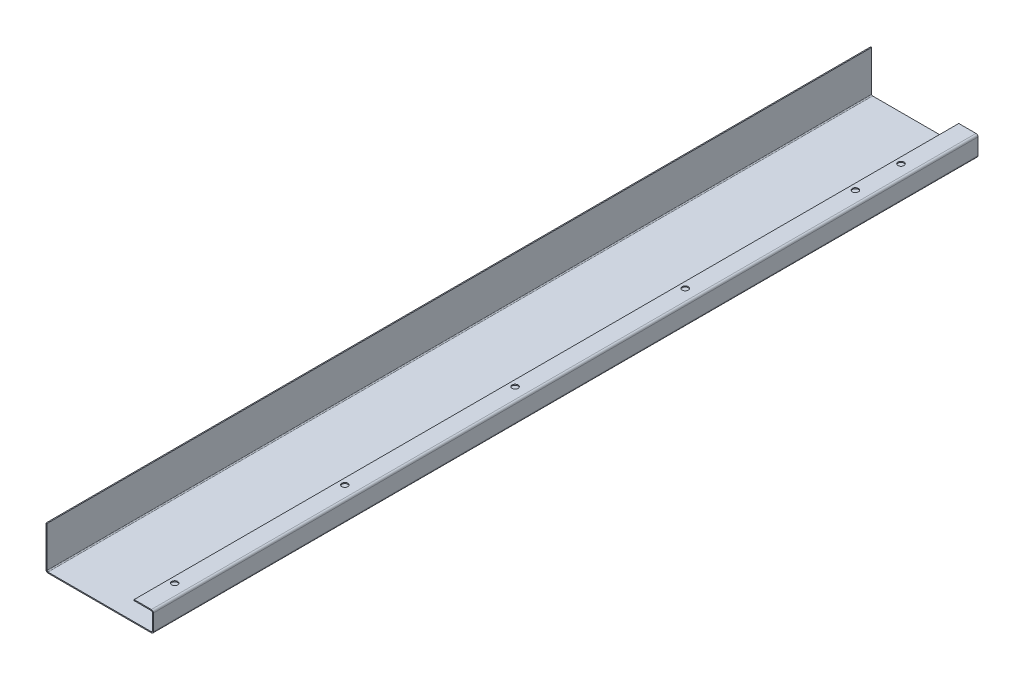
ISO-10303-21;
HEADER;
FILE_DESCRIPTION(('STEP AP214'),'2;1');
FILE_NAME('part.step','',(''),(''),'','','');
FILE_SCHEMA(('AUTOMOTIVE_DESIGN { 1 0 10303 214 1 1 1 1 }'));
ENDSEC;
DATA;
#1=APPLICATION_CONTEXT('core data for automotive mechanical design processes');
#2=APPLICATION_PROTOCOL_DEFINITION('international standard','automotive_design',2000,#1);
#3=PRODUCT_CONTEXT('',#1,'mechanical');
#4=PRODUCT('Part','Part','',(#3));
#5=PRODUCT_RELATED_PRODUCT_CATEGORY('part','',(#4));
#6=PRODUCT_DEFINITION_FORMATION('','',#4);
#7=PRODUCT_DEFINITION_CONTEXT('part definition',#1,'design');
#8=PRODUCT_DEFINITION('design','',#6,#7);
#9=PRODUCT_DEFINITION_SHAPE('','',#8);
#10=(LENGTH_UNIT() NAMED_UNIT(*) SI_UNIT(.MILLI.,.METRE.));
#11=(NAMED_UNIT(*) PLANE_ANGLE_UNIT() SI_UNIT($,.RADIAN.));
#12=(NAMED_UNIT(*) SI_UNIT($,.STERADIAN.) SOLID_ANGLE_UNIT());
#13=UNCERTAINTY_MEASURE_WITH_UNIT(LENGTH_MEASURE(1.E-05),#10,'distance_accuracy_value','');
#14=(GEOMETRIC_REPRESENTATION_CONTEXT(3) GLOBAL_UNCERTAINTY_ASSIGNED_CONTEXT((#13)) GLOBAL_UNIT_ASSIGNED_CONTEXT((#10,
#11,#12)) REPRESENTATION_CONTEXT('',''));
#15=CARTESIAN_POINT('',(0.,0.,0.));
#16=DIRECTION('',(0.,0.,1.));
#17=DIRECTION('',(1.,0.,0.));
#18=AXIS2_PLACEMENT_3D('',#15,#16,#17);
#19=CARTESIAN_POINT('',(0.,-1.,0.));
#20=DIRECTION('',(0.,-1.,0.));
#21=DIRECTION('',(0.,0.,-1.));
#22=AXIS2_PLACEMENT_3D('',#19,#20,#21);
#23=PLANE('',#22);
#24=DIRECTION('',(1.,0.,0.));
#25=VECTOR('',#24,1.);
#26=CARTESIAN_POINT('',(0.,-1.,0.));
#27=LINE('',#26,#25);
#28=CARTESIAN_POINT('',(2.00000000000007,-1.0000000000001,0.));
#29=VERTEX_POINT('',#28);
#30=CARTESIAN_POINT('',(104.,-1.,0.));
#31=VERTEX_POINT('',#30);
#32=EDGE_CURVE('E109',#29,#31,#27,.T.);
#33=ORIENTED_EDGE('',*,*,#32,.F.);
#34=DIRECTION('',(0.,0.,1.));
#35=VECTOR('',#34,1.);
#36=CARTESIAN_POINT('',(2.00000000000007,-1.0000000000001,0.));
#37=LINE('',#36,#35);
#38=CARTESIAN_POINT('',(2.,-1.,-814.));
#39=VERTEX_POINT('',#38);
#40=EDGE_CURVE('E259',#29,#39,#37,.F.);
#41=ORIENTED_EDGE('',*,*,#40,.T.);
#42=DIRECTION('',(-1.,0.,0.));
#43=VECTOR('',#42,1.);
#44=CARTESIAN_POINT('',(-1.38777878078145E-13,-1.,-814.));
#45=LINE('',#44,#43);
#46=CARTESIAN_POINT('',(104.,-1.0000000000001,-814.));
#47=VERTEX_POINT('',#46);
#48=EDGE_CURVE('E13',#47,#39,#45,.T.);
#49=ORIENTED_EDGE('',*,*,#48,.F.);
#50=DIRECTION('',(0.,0.,-1.));
#51=VECTOR('',#50,1.);
#52=CARTESIAN_POINT('',(104.,-1.0000000000001,-814.));
#53=LINE('',#52,#51);
#54=EDGE_CURVE('E352',#47,#31,#53,.F.);
#55=ORIENTED_EDGE('',*,*,#54,.T.);
#56=EDGE_LOOP('',(#33,#41,#49,#55));
#57=FACE_BOUND('',#56,.T.);
#58=ADVANCED_FACE('F100',(#57),#23,.T.);
#59=CARTESIAN_POINT('',(0.,0.,0.));
#60=DIRECTION('',(0.,-1.,0.));
#61=DIRECTION('',(0.,0.,-1.));
#62=AXIS2_PLACEMENT_3D('',#59,#60,#61);
#63=PLANE('',#62);
#64=DIRECTION('',(0.,0.,1.));
#65=VECTOR('',#64,1.);
#66=CARTESIAN_POINT('',(2.,0.,0.));
#67=LINE('',#66,#65);
#68=CARTESIAN_POINT('',(2.,0.,0.));
#69=VERTEX_POINT('',#68);
#70=CARTESIAN_POINT('',(2.,0.,-814.));
#71=VERTEX_POINT('',#70);
#72=EDGE_CURVE('E272',#69,#71,#67,.F.);
#73=ORIENTED_EDGE('',*,*,#72,.F.);
#74=DIRECTION('',(1.,0.,0.));
#75=VECTOR('',#74,1.);
#76=CARTESIAN_POINT('',(0.,0.,0.));
#77=LINE('',#76,#75);
#78=CARTESIAN_POINT('',(104.,-1.00397121172158E-13,0.));
#79=VERTEX_POINT('',#78);
#80=EDGE_CURVE('E373',#69,#79,#77,.T.);
#81=ORIENTED_EDGE('',*,*,#80,.T.);
#82=DIRECTION('',(0.,0.,-1.));
#83=VECTOR('',#82,1.);
#84=CARTESIAN_POINT('',(104.,-1.00397121172158E-13,-814.));
#85=LINE('',#84,#83);
#86=CARTESIAN_POINT('',(104.,-1.00397121172158E-13,-814.));
#87=VERTEX_POINT('',#86);
#88=EDGE_CURVE('E365',#87,#79,#85,.F.);
#89=ORIENTED_EDGE('',*,*,#88,.F.);
#90=DIRECTION('',(-1.,0.,0.));
#91=VECTOR('',#90,1.);
#92=CARTESIAN_POINT('',(-1.38777878078145E-13,0.,-814.));
#93=LINE('',#92,#91);
#94=EDGE_CURVE('E376',#87,#71,#93,.T.);
#95=ORIENTED_EDGE('',*,*,#94,.T.);
#96=EDGE_LOOP('',(#73,#81,#89,#95));
#97=FACE_BOUND('',#96,.T.);
#98=ADVANCED_FACE('F458',(#97),#63,.F.);
#99=CARTESIAN_POINT('',(0.,-1.,0.));
#100=DIRECTION('',(0.,0.,1.));
#101=DIRECTION('',(1.,0.,0.));
#102=AXIS2_PLACEMENT_3D('',#99,#100,#101);
#103=PLANE('',#102);
#104=ORIENTED_EDGE('',*,*,#80,.F.);
#105=DIRECTION('',(0.,-1.,0.));
#106=VECTOR('',#105,1.);
#107=CARTESIAN_POINT('',(2.,0.,0.));
#108=LINE('',#107,#106);
#109=EDGE_CURVE('E266',#69,#29,#108,.T.);
#110=ORIENTED_EDGE('',*,*,#109,.T.);
#111=ORIENTED_EDGE('',*,*,#32,.T.);
#112=DIRECTION('',(0.,-1.,0.));
#113=VECTOR('',#112,1.);
#114=CARTESIAN_POINT('',(104.,-1.00397121172158E-13,0.));
#115=LINE('',#114,#113);
#116=EDGE_CURVE('E370',#79,#31,#115,.T.);
#117=ORIENTED_EDGE('',*,*,#116,.F.);
#118=EDGE_LOOP('',(#104,#110,#111,#117));
#119=FACE_BOUND('',#118,.T.);
#120=ADVANCED_FACE('F102',(#119),#103,.T.);
#121=CARTESIAN_POINT('',(106.,0.,0.));
#122=DIRECTION('',(0.,0.,-1.));
#123=DIRECTION('',(0.,1.,0.));
#124=AXIS2_PLACEMENT_3D('',#121,#122,#123);
#125=PLANE('',#124);
#126=DIRECTION('',(1.,0.,0.));
#127=VECTOR('',#126,1.);
#128=CARTESIAN_POINT('',(105.000000000003,17.,0.));
#129=LINE('',#128,#127);
#130=CARTESIAN_POINT('',(105.000000000003,17.,0.));
#131=VERTEX_POINT('',#130);
#132=CARTESIAN_POINT('',(106.,17.,0.));
#133=VERTEX_POINT('',#132);
#134=EDGE_CURVE('E327',#131,#133,#129,.T.);
#135=ORIENTED_EDGE('',*,*,#134,.F.);
#136=DIRECTION('',(0.,1.,0.));
#137=VECTOR('',#136,1.);
#138=CARTESIAN_POINT('',(105.,0.,0.));
#139=LINE('',#138,#137);
#140=CARTESIAN_POINT('',(105.,0.99999999999998,0.));
#141=VERTEX_POINT('',#140);
#142=EDGE_CURVE('E340',#131,#141,#139,.F.);
#143=ORIENTED_EDGE('',*,*,#142,.T.);
#144=DIRECTION('',(-1.,0.,0.));
#145=VECTOR('',#144,1.);
#146=CARTESIAN_POINT('',(106.,0.999999999999997,0.));
#147=LINE('',#146,#145);
#148=CARTESIAN_POINT('',(106.,0.999999999999976,0.));
#149=VERTEX_POINT('',#148);
#150=EDGE_CURVE('E330',#141,#149,#147,.F.);
#151=ORIENTED_EDGE('',*,*,#150,.T.);
#152=DIRECTION('',(0.,-1.,0.));
#153=VECTOR('',#152,1.);
#154=CARTESIAN_POINT('',(106.,-3.90608720188404E-13,0.));
#155=LINE('',#154,#153);
#156=EDGE_CURVE('E336',#133,#149,#155,.T.);
#157=ORIENTED_EDGE('',*,*,#156,.F.);
#158=EDGE_LOOP('',(#135,#143,#151,#157));
#159=FACE_BOUND('',#158,.T.);
#160=ADVANCED_FACE('F507',(#159),#125,.F.);
#161=CARTESIAN_POINT('',(106.,19.,-814.));
#162=DIRECTION('',(0.,0.,1.));
#163=DIRECTION('',(1.,0.,0.));
#164=AXIS2_PLACEMENT_3D('',#161,#162,#163);
#165=PLANE('',#164);
#166=DIRECTION('',(1.,0.,0.));
#167=VECTOR('',#166,1.);
#168=CARTESIAN_POINT('',(104.999999999997,17.,-814.));
#169=LINE('',#168,#167);
#170=CARTESIAN_POINT('',(105.,17.,-814.));
#171=VERTEX_POINT('',#170);
#172=CARTESIAN_POINT('',(105.999999999997,17.,-814.));
#173=VERTEX_POINT('',#172);
#174=EDGE_CURVE('E318',#171,#173,#169,.T.);
#175=ORIENTED_EDGE('',*,*,#174,.T.);
#176=DIRECTION('',(0.,1.,0.));
#177=VECTOR('',#176,1.);
#178=CARTESIAN_POINT('',(106.,-3.90608720188404E-13,-814.));
#179=LINE('',#178,#177);
#180=CARTESIAN_POINT('',(106.,0.999999999999956,-814.));
#181=VERTEX_POINT('',#180);
#182=EDGE_CURVE('E333',#181,#173,#179,.T.);
#183=ORIENTED_EDGE('',*,*,#182,.F.);
#184=DIRECTION('',(-1.,0.,0.));
#185=VECTOR('',#184,1.);
#186=CARTESIAN_POINT('',(105.,0.999999999999959,-814.));
#187=LINE('',#186,#185);
#188=CARTESIAN_POINT('',(105.,0.99999999999998,-814.));
#189=VERTEX_POINT('',#188);
#190=EDGE_CURVE('E345',#189,#181,#187,.F.);
#191=ORIENTED_EDGE('',*,*,#190,.F.);
#192=DIRECTION('',(0.,-1.,0.));
#193=VECTOR('',#192,1.);
#194=CARTESIAN_POINT('',(105.,19.,-814.));
#195=LINE('',#194,#193);
#196=EDGE_CURVE('E338',#189,#171,#195,.F.);
#197=ORIENTED_EDGE('',*,*,#196,.T.);
#198=EDGE_LOOP('',(#175,#183,#191,#197));
#199=FACE_BOUND('',#198,.T.);
#200=ADVANCED_FACE('F505',(#199),#165,.F.);
#201=CARTESIAN_POINT('',(106.,-3.90608720188404E-13,0.));
#202=DIRECTION('',(-1.,0.,0.));
#203=DIRECTION('',(0.,-1.,0.));
#204=AXIS2_PLACEMENT_3D('',#201,#202,#203);
#205=PLANE('',#204);
#206=DIRECTION('',(0.,0.,-1.));
#207=VECTOR('',#206,1.);
#208=CARTESIAN_POINT('',(105.999999999997,17.,-814.));
#209=LINE('',#208,#207);
#210=EDGE_CURVE('E312',#173,#133,#209,.F.);
#211=ORIENTED_EDGE('',*,*,#210,.T.);
#212=ORIENTED_EDGE('',*,*,#156,.T.);
#213=DIRECTION('',(0.,0.,-1.));
#214=VECTOR('',#213,1.);
#215=CARTESIAN_POINT('',(106.,0.999999999999997,0.));
#216=LINE('',#215,#214);
#217=EDGE_CURVE('E342',#181,#149,#216,.F.);
#218=ORIENTED_EDGE('',*,*,#217,.F.);
#219=ORIENTED_EDGE('',*,*,#182,.T.);
#220=EDGE_LOOP('',(#211,#212,#218,#219));
#221=FACE_BOUND('',#220,.T.);
#222=ADVANCED_FACE('F479',(#221),#205,.F.);
#223=CARTESIAN_POINT('',(105.,-3.87117238849561E-13,0.));
#224=DIRECTION('',(-1.,0.,0.));
#225=DIRECTION('',(0.,-1.,0.));
#226=AXIS2_PLACEMENT_3D('',#223,#224,#225);
#227=PLANE('',#226);
#228=ORIENTED_EDGE('',*,*,#142,.F.);
#229=DIRECTION('',(0.,0.,-1.));
#230=VECTOR('',#229,1.);
#231=CARTESIAN_POINT('',(104.999999999997,17.,-814.));
#232=LINE('',#231,#230);
#233=EDGE_CURVE('E117',#171,#131,#232,.F.);
#234=ORIENTED_EDGE('',*,*,#233,.F.);
#235=ORIENTED_EDGE('',*,*,#196,.F.);
#236=DIRECTION('',(0.,0.,-1.));
#237=VECTOR('',#236,1.);
#238=CARTESIAN_POINT('',(105.,1.,0.));
#239=LINE('',#238,#237);
#240=EDGE_CURVE('E348',#141,#189,#239,.T.);
#241=ORIENTED_EDGE('',*,*,#240,.F.);
#242=EDGE_LOOP('',(#228,#234,#235,#241));
#243=FACE_BOUND('',#242,.T.);
#244=ADVANCED_FACE('F472',(#243),#227,.T.);
#245=CARTESIAN_POINT('',(-1.38777878078145E-13,-1.,-814.));
#246=DIRECTION('',(0.,0.,-1.));
#247=DIRECTION('',(-1.,0.,0.));
#248=AXIS2_PLACEMENT_3D('',#245,#246,#247);
#249=PLANE('',#248);
#250=DIRECTION('',(0.,-1.,0.));
#251=VECTOR('',#250,1.);
#252=CARTESIAN_POINT('',(2.,0.,-814.));
#253=LINE('',#252,#251);
#254=EDGE_CURVE('E277',#71,#39,#253,.T.);
#255=ORIENTED_EDGE('',*,*,#254,.F.);
#256=ORIENTED_EDGE('',*,*,#94,.F.);
#257=DIRECTION('',(0.,-1.,0.));
#258=VECTOR('',#257,1.);
#259=CARTESIAN_POINT('',(104.,-1.00397121172158E-13,-814.));
#260=LINE('',#259,#258);
#261=EDGE_CURVE('E359',#87,#47,#260,.T.);
#262=ORIENTED_EDGE('',*,*,#261,.T.);
#263=ORIENTED_EDGE('',*,*,#48,.T.);
#264=EDGE_LOOP('',(#255,#256,#262,#263));
#265=FACE_BOUND('',#264,.T.);
#266=ADVANCED_FACE('F469',(#265),#249,.T.);
#267=CARTESIAN_POINT('',(104.,0.999999999999984,0.));
#268=DIRECTION('',(0.,0.,1.));
#269=DIRECTION('',(1.,0.,0.));
#270=AXIS2_PLACEMENT_3D('',#267,#268,#269);
#271=PLANE('',#270);
#272=ORIENTED_EDGE('',*,*,#150,.F.);
#273=CARTESIAN_POINT('',(104.,0.999999999999984,0.));
#274=DIRECTION('',(0.,0.,-1.));
#275=DIRECTION('',(-1.,0.,0.));
#276=AXIS2_PLACEMENT_3D('',#273,#274,#275);
#277=CIRCLE('',#276,1.00000000000008);
#278=EDGE_CURVE('E362',#79,#141,#277,.F.);
#279=ORIENTED_EDGE('',*,*,#278,.F.);
#280=ORIENTED_EDGE('',*,*,#116,.T.);
#281=CARTESIAN_POINT('',(104.,0.999999999999984,0.));
#282=DIRECTION('',(0.,0.,-1.));
#283=DIRECTION('',(-1.,0.,0.));
#284=AXIS2_PLACEMENT_3D('',#281,#282,#283);
#285=CIRCLE('',#284,2.00000000000008);
#286=EDGE_CURVE('E355',#31,#149,#285,.F.);
#287=ORIENTED_EDGE('',*,*,#286,.T.);
#288=EDGE_LOOP('',(#272,#279,#280,#287));
#289=FACE_BOUND('',#288,.T.);
#290=ADVANCED_FACE('F471',(#289),#271,.T.);
#291=CARTESIAN_POINT('',(104.,0.999999999999984,-814.));
#292=DIRECTION('',(0.,0.,1.));
#293=DIRECTION('',(1.,0.,0.));
#294=AXIS2_PLACEMENT_3D('',#291,#292,#293);
#295=PLANE('',#294);
#296=CARTESIAN_POINT('',(104.,0.999999999999984,-814.));
#297=DIRECTION('',(0.,0.,-1.));
#298=DIRECTION('',(-1.,0.,0.));
#299=AXIS2_PLACEMENT_3D('',#296,#297,#298);
#300=CIRCLE('',#299,1.00000000000008);
#301=EDGE_CURVE('E335',#189,#87,#300,.T.);
#302=ORIENTED_EDGE('',*,*,#301,.F.);
#303=ORIENTED_EDGE('',*,*,#190,.T.);
#304=CARTESIAN_POINT('',(104.,0.999999999999984,-814.));
#305=DIRECTION('',(0.,0.,-1.));
#306=DIRECTION('',(-1.,0.,0.));
#307=AXIS2_PLACEMENT_3D('',#304,#305,#306);
#308=CIRCLE('',#307,2.00000000000008);
#309=EDGE_CURVE('E356',#181,#47,#308,.T.);
#310=ORIENTED_EDGE('',*,*,#309,.T.);
#311=ORIENTED_EDGE('',*,*,#261,.F.);
#312=EDGE_LOOP('',(#302,#303,#310,#311));
#313=FACE_BOUND('',#312,.T.);
#314=ADVANCED_FACE('F467',(#313),#295,.F.);
#315=CARTESIAN_POINT('',(104.,0.999999999999984,-814.));
#316=DIRECTION('',(0.,0.,-1.));
#317=DIRECTION('',(1.,0.,0.));
#318=AXIS2_PLACEMENT_3D('',#315,#316,#317);
#319=CYLINDRICAL_SURFACE('',#318,2.00000000000008);
#320=ORIENTED_EDGE('',*,*,#54,.F.);
#321=ORIENTED_EDGE('',*,*,#309,.F.);
#322=ORIENTED_EDGE('',*,*,#217,.T.);
#323=ORIENTED_EDGE('',*,*,#286,.F.);
#324=EDGE_LOOP('',(#320,#321,#322,#323));
#325=FACE_BOUND('',#324,.T.);
#326=ADVANCED_FACE('F497',(#325),#319,.T.);
#327=CARTESIAN_POINT('',(104.,0.999999999999984,-814.));
#328=DIRECTION('',(0.,0.,-1.));
#329=DIRECTION('',(1.,0.,0.));
#330=AXIS2_PLACEMENT_3D('',#327,#328,#329);
#331=CYLINDRICAL_SURFACE('',#330,1.00000000000008);
#332=ORIENTED_EDGE('',*,*,#88,.T.);
#333=ORIENTED_EDGE('',*,*,#278,.T.);
#334=ORIENTED_EDGE('',*,*,#240,.T.);
#335=ORIENTED_EDGE('',*,*,#301,.T.);
#336=EDGE_LOOP('',(#332,#333,#334,#335));
#337=FACE_BOUND('',#336,.T.);
#338=ADVANCED_FACE('F490',(#337),#331,.F.);
#339=CARTESIAN_POINT('',(104.000000000003,17.,0.));
#340=DIRECTION('',(0.,0.,1.));
#341=DIRECTION('',(1.,0.,0.));
#342=AXIS2_PLACEMENT_3D('',#339,#340,#341);
#343=PLANE('',#342);
#344=DIRECTION('',(0.,-1.,0.));
#345=VECTOR('',#344,1.);
#346=CARTESIAN_POINT('',(104.,19.,0.));
#347=LINE('',#346,#345);
#348=CARTESIAN_POINT('',(104.000000000003,18.,0.));
#349=VERTEX_POINT('',#348);
#350=CARTESIAN_POINT('',(104.000000000003,19.,0.));
#351=VERTEX_POINT('',#350);
#352=EDGE_CURVE('E280',#349,#351,#347,.F.);
#353=ORIENTED_EDGE('',*,*,#352,.F.);
#354=CARTESIAN_POINT('',(104.000000000003,17.,0.));
#355=DIRECTION('',(0.,0.,-1.));
#356=DIRECTION('',(-1.,0.,0.));
#357=AXIS2_PLACEMENT_3D('',#354,#355,#356);
#358=CIRCLE('',#357,1.);
#359=EDGE_CURVE('E321',#131,#349,#358,.F.);
#360=ORIENTED_EDGE('',*,*,#359,.F.);
#361=ORIENTED_EDGE('',*,*,#134,.T.);
#362=CARTESIAN_POINT('',(104.000000000003,17.,0.));
#363=DIRECTION('',(0.,0.,-1.));
#364=DIRECTION('',(-1.,0.,0.));
#365=AXIS2_PLACEMENT_3D('',#362,#363,#364);
#366=CIRCLE('',#365,2.);
#367=EDGE_CURVE('E314',#133,#351,#366,.F.);
#368=ORIENTED_EDGE('',*,*,#367,.T.);
#369=EDGE_LOOP('',(#353,#360,#361,#368));
#370=FACE_BOUND('',#369,.T.);
#371=ADVANCED_FACE('F440',(#370),#343,.T.);
#372=CARTESIAN_POINT('',(103.999999999997,17.,-814.));
#373=DIRECTION('',(0.,0.,1.));
#374=DIRECTION('',(1.,0.,0.));
#375=AXIS2_PLACEMENT_3D('',#372,#373,#374);
#376=PLANE('',#375);
#377=CARTESIAN_POINT('',(103.999999999997,17.,-814.));
#378=DIRECTION('',(0.,0.,-1.));
#379=DIRECTION('',(-1.,0.,0.));
#380=AXIS2_PLACEMENT_3D('',#377,#378,#379);
#381=CIRCLE('',#380,1.);
#382=CARTESIAN_POINT('',(103.999999999997,18.,-814.));
#383=VERTEX_POINT('',#382);
#384=EDGE_CURVE('E285',#383,#171,#381,.T.);
#385=ORIENTED_EDGE('',*,*,#384,.F.);
#386=DIRECTION('',(0.,-1.,0.));
#387=VECTOR('',#386,1.);
#388=CARTESIAN_POINT('',(104.,18.,-814.));
#389=LINE('',#388,#387);
#390=CARTESIAN_POINT('',(104.,19.,-814.));
#391=VERTEX_POINT('',#390);
#392=EDGE_CURVE('E305',#383,#391,#389,.F.);
#393=ORIENTED_EDGE('',*,*,#392,.T.);
#394=CARTESIAN_POINT('',(103.999999999997,17.,-814.));
#395=DIRECTION('',(0.,0.,-1.));
#396=DIRECTION('',(-1.,0.,0.));
#397=AXIS2_PLACEMENT_3D('',#394,#395,#396);
#398=CIRCLE('',#397,2.);
#399=EDGE_CURVE('E315',#391,#173,#398,.T.);
#400=ORIENTED_EDGE('',*,*,#399,.T.);
#401=ORIENTED_EDGE('',*,*,#174,.F.);
#402=EDGE_LOOP('',(#385,#393,#400,#401));
#403=FACE_BOUND('',#402,.T.);
#404=ADVANCED_FACE('F430',(#403),#376,.F.);
#405=CARTESIAN_POINT('',(103.999999999997,17.,-814.));
#406=DIRECTION('',(0.,0.,-1.));
#407=DIRECTION('',(0.,1.,0.));
#408=AXIS2_PLACEMENT_3D('',#405,#406,#407);
#409=CYLINDRICAL_SURFACE('',#408,2.);
#410=ORIENTED_EDGE('',*,*,#210,.F.);
#411=ORIENTED_EDGE('',*,*,#399,.F.);
#412=DIRECTION('',(0.,0.,-1.));
#413=VECTOR('',#412,1.);
#414=CARTESIAN_POINT('',(104.,19.,0.));
#415=LINE('',#414,#413);
#416=EDGE_CURVE('E303',#391,#351,#415,.F.);
#417=ORIENTED_EDGE('',*,*,#416,.T.);
#418=ORIENTED_EDGE('',*,*,#367,.F.);
#419=EDGE_LOOP('',(#410,#411,#417,#418));
#420=FACE_BOUND('',#419,.T.);
#421=ADVANCED_FACE('F438',(#420),#409,.T.);
#422=CARTESIAN_POINT('',(103.999999999997,17.,-814.));
#423=DIRECTION('',(0.,0.,-1.));
#424=DIRECTION('',(0.,1.,0.));
#425=AXIS2_PLACEMENT_3D('',#422,#423,#424);
#426=CYLINDRICAL_SURFACE('',#425,1.);
#427=ORIENTED_EDGE('',*,*,#233,.T.);
#428=ORIENTED_EDGE('',*,*,#359,.T.);
#429=DIRECTION('',(0.,0.,-1.));
#430=VECTOR('',#429,1.);
#431=CARTESIAN_POINT('',(104.,18.,0.));
#432=LINE('',#431,#430);
#433=EDGE_CURVE('E308',#349,#383,#432,.T.);
#434=ORIENTED_EDGE('',*,*,#433,.T.);
#435=ORIENTED_EDGE('',*,*,#384,.T.);
#436=EDGE_LOOP('',(#427,#428,#434,#435));
#437=FACE_BOUND('',#436,.T.);
#438=ADVANCED_FACE('F509',(#437),#426,.F.);
#439=CARTESIAN_POINT('',(86.9999999999999,19.0000000000001,-814.));
#440=DIRECTION('',(0.,0.,1.));
#441=DIRECTION('',(0.,-1.,0.));
#442=AXIS2_PLACEMENT_3D('',#439,#440,#441);
#443=PLANE('',#442);
#444=ORIENTED_EDGE('',*,*,#392,.F.);
#445=DIRECTION('',(1.,0.,0.));
#446=VECTOR('',#445,1.);
#447=CARTESIAN_POINT('',(86.9999999999999,18.0000000000001,-814.));
#448=LINE('',#447,#446);
#449=CARTESIAN_POINT('',(86.9999999999999,18.0000000000001,-814.));
#450=VERTEX_POINT('',#449);
#451=EDGE_CURVE('E301',#383,#450,#448,.F.);
#452=ORIENTED_EDGE('',*,*,#451,.T.);
#453=DIRECTION('',(0.,-1.,0.));
#454=VECTOR('',#453,1.);
#455=CARTESIAN_POINT('',(86.9999999999999,19.0000000000001,-814.));
#456=LINE('',#455,#454);
#457=CARTESIAN_POINT('',(86.9999999999999,19.0000000000001,-814.));
#458=VERTEX_POINT('',#457);
#459=EDGE_CURVE('E282',#458,#450,#456,.T.);
#460=ORIENTED_EDGE('',*,*,#459,.F.);
#461=DIRECTION('',(-1.,0.,0.));
#462=VECTOR('',#461,1.);
#463=CARTESIAN_POINT('',(1.38992659517926E-13,19.0000000000007,-814.));
#464=LINE('',#463,#462);
#465=EDGE_CURVE('E294',#391,#458,#464,.T.);
#466=ORIENTED_EDGE('',*,*,#465,.F.);
#467=EDGE_LOOP('',(#444,#452,#460,#466));
#468=FACE_BOUND('',#467,.T.);
#469=ADVANCED_FACE('F425',(#468),#443,.F.);
#470=CARTESIAN_POINT('',(105.,19.,0.));
#471=DIRECTION('',(0.,0.,-1.));
#472=DIRECTION('',(-1.,0.,0.));
#473=AXIS2_PLACEMENT_3D('',#470,#471,#472);
#474=PLANE('',#473);
#475=ORIENTED_EDGE('',*,*,#352,.T.);
#476=DIRECTION('',(1.,0.,0.));
#477=VECTOR('',#476,1.);
#478=CARTESIAN_POINT('',(1.38992659517926E-13,19.0000000000007,0.));
#479=LINE('',#478,#477);
#480=CARTESIAN_POINT('',(87.0000000000001,19.0000000000001,0.));
#481=VERTEX_POINT('',#480);
#482=EDGE_CURVE('E289',#481,#351,#479,.T.);
#483=ORIENTED_EDGE('',*,*,#482,.F.);
#484=DIRECTION('',(0.,-1.,0.));
#485=VECTOR('',#484,1.);
#486=CARTESIAN_POINT('',(87.0000000000001,19.0000000000001,0.));
#487=LINE('',#486,#485);
#488=CARTESIAN_POINT('',(87.0000000000001,18.0000000000001,0.));
#489=VERTEX_POINT('',#488);
#490=EDGE_CURVE('E286',#481,#489,#487,.T.);
#491=ORIENTED_EDGE('',*,*,#490,.T.);
#492=DIRECTION('',(-1.,0.,0.));
#493=VECTOR('',#492,1.);
#494=CARTESIAN_POINT('',(105.,18.,0.));
#495=LINE('',#494,#493);
#496=EDGE_CURVE('E296',#489,#349,#495,.F.);
#497=ORIENTED_EDGE('',*,*,#496,.T.);
#498=EDGE_LOOP('',(#475,#483,#491,#497));
#499=FACE_BOUND('',#498,.T.);
#500=ADVANCED_FACE('F443',(#499),#474,.F.);
#501=CARTESIAN_POINT('',(1.38992659517926E-13,19.0000000000007,0.));
#502=DIRECTION('',(0.,-1.,0.));
#503=DIRECTION('',(1.,0.,0.));
#504=AXIS2_PLACEMENT_3D('',#501,#502,#503);
#505=PLANE('',#504);
#506=CARTESIAN_POINT('',(92.9999999999999,19.0000000000001,-751.));
#507=DIRECTION('',(0.,1.,0.));
#508=DIRECTION('',(-1.,0.,0.));
#509=AXIS2_PLACEMENT_3D('',#506,#507,#508);
#510=CIRCLE('',#509,3.00000000000001);
#511=CARTESIAN_POINT('',(89.9999999999999,19.0000000000001,-751.));
#512=VERTEX_POINT('',#511);
#513=EDGE_CURVE('E385',#512,#512,#510,.T.);
#514=ORIENTED_EDGE('',*,*,#513,.F.);
#515=EDGE_LOOP('',(#514));
#516=FACE_BOUND('',#515,.T.);
#517=CARTESIAN_POINT('',(92.9999999999999,19.0000000000001,-706.));
#518=DIRECTION('',(0.,1.,0.));
#519=DIRECTION('',(-1.,0.,0.));
#520=AXIS2_PLACEMENT_3D('',#517,#518,#519);
#521=CIRCLE('',#520,3.00000000000001);
#522=CARTESIAN_POINT('',(89.9999999999999,19.0000000000001,-706.));
#523=VERTEX_POINT('',#522);
#524=EDGE_CURVE('E791',#523,#523,#521,.T.);
#525=ORIENTED_EDGE('',*,*,#524,.F.);
#526=EDGE_LOOP('',(#525));
#527=FACE_BOUND('',#526,.T.);
#528=CARTESIAN_POINT('',(93.0000000000041,19.0000000000001,-538.));
#529=DIRECTION('',(0.,1.,0.));
#530=DIRECTION('',(-1.,0.,0.));
#531=AXIS2_PLACEMENT_3D('',#528,#529,#530);
#532=CIRCLE('',#531,3.00000000000001);
#533=CARTESIAN_POINT('',(90.0000000000041,19.0000000000001,-538.));
#534=VERTEX_POINT('',#533);
#535=EDGE_CURVE('E793',#534,#534,#532,.T.);
#536=ORIENTED_EDGE('',*,*,#535,.F.);
#537=EDGE_LOOP('',(#536));
#538=FACE_BOUND('',#537,.T.);
#539=CARTESIAN_POINT('',(93.0000000000082,19.0000000000001,-370.));
#540=DIRECTION('',(0.,1.,0.));
#541=DIRECTION('',(-1.,0.,0.));
#542=AXIS2_PLACEMENT_3D('',#539,#540,#541);
#543=CIRCLE('',#542,3.00000000000001);
#544=CARTESIAN_POINT('',(90.0000000000082,19.0000000000001,-370.));
#545=VERTEX_POINT('',#544);
#546=EDGE_CURVE('E798',#545,#545,#543,.T.);
#547=ORIENTED_EDGE('',*,*,#546,.F.);
#548=EDGE_LOOP('',(#547));
#549=FACE_BOUND('',#548,.T.);
#550=CARTESIAN_POINT('',(93.0000000000124,19.0000000000001,-202.));
#551=DIRECTION('',(0.,1.,0.));
#552=DIRECTION('',(-1.,0.,0.));
#553=AXIS2_PLACEMENT_3D('',#550,#551,#552);
#554=CIRCLE('',#553,3.00000000000001);
#555=CARTESIAN_POINT('',(90.0000000000124,19.0000000000001,-202.));
#556=VERTEX_POINT('',#555);
#557=EDGE_CURVE('E803',#556,#556,#554,.T.);
#558=ORIENTED_EDGE('',*,*,#557,.F.);
#559=EDGE_LOOP('',(#558));
#560=FACE_BOUND('',#559,.T.);
#561=CARTESIAN_POINT('',(93.0000000000165,19.0000000000001,-33.9999999999998));
#562=DIRECTION('',(0.,1.,0.));
#563=DIRECTION('',(-1.,0.,0.));
#564=AXIS2_PLACEMENT_3D('',#561,#562,#563);
#565=CIRCLE('',#564,3.00000000000001);
#566=CARTESIAN_POINT('',(90.0000000000165,19.0000000000001,-33.9999999999998));
#567=VERTEX_POINT('',#566);
#568=EDGE_CURVE('E806',#567,#567,#565,.T.);
#569=ORIENTED_EDGE('',*,*,#568,.F.);
#570=EDGE_LOOP('',(#569));
#571=FACE_BOUND('',#570,.T.);
#572=ORIENTED_EDGE('',*,*,#416,.F.);
#573=ORIENTED_EDGE('',*,*,#465,.T.);
#574=DIRECTION('',(0.,0.,1.));
#575=VECTOR('',#574,1.);
#576=CARTESIAN_POINT('',(87.0000000000001,19.0000000000001,0.));
#577=LINE('',#576,#575);
#578=EDGE_CURVE('E292',#458,#481,#577,.T.);
#579=ORIENTED_EDGE('',*,*,#578,.T.);
#580=ORIENTED_EDGE('',*,*,#482,.T.);
#581=EDGE_LOOP('',(#572,#573,#579,#580));
#582=FACE_BOUND('',#581,.T.);
#583=ADVANCED_FACE('F407',(#516,#527,#538,#549,#560,#571,#582),#505,.F.);
#584=CARTESIAN_POINT('',(1.31849128755974E-13,18.0000000000007,0.));
#585=DIRECTION('',(0.,-1.,0.));
#586=DIRECTION('',(1.,0.,0.));
#587=AXIS2_PLACEMENT_3D('',#584,#585,#586);
#588=PLANE('',#587);
#589=CARTESIAN_POINT('',(92.9999999999999,18.0000000000001,-751.));
#590=DIRECTION('',(0.,-1.,0.));
#591=DIRECTION('',(1.,0.,0.));
#592=AXIS2_PLACEMENT_3D('',#589,#590,#591);
#593=CIRCLE('',#592,3.00000000000001);
#594=CARTESIAN_POINT('',(95.9999999999999,18.0000000000001,-751.));
#595=VERTEX_POINT('',#594);
#596=EDGE_CURVE('E104',#595,#595,#593,.T.);
#597=ORIENTED_EDGE('',*,*,#596,.F.);
#598=EDGE_LOOP('',(#597));
#599=FACE_BOUND('',#598,.T.);
#600=CARTESIAN_POINT('',(92.9999999999999,18.0000000000001,-706.));
#601=DIRECTION('',(0.,-1.,0.));
#602=DIRECTION('',(1.,0.,0.));
#603=AXIS2_PLACEMENT_3D('',#600,#601,#602);
#604=CIRCLE('',#603,3.00000000000001);
#605=CARTESIAN_POINT('',(95.9999999999999,18.0000000000001,-706.));
#606=VERTEX_POINT('',#605);
#607=EDGE_CURVE('E393',#606,#606,#604,.T.);
#608=ORIENTED_EDGE('',*,*,#607,.F.);
#609=EDGE_LOOP('',(#608));
#610=FACE_BOUND('',#609,.T.);
#611=CARTESIAN_POINT('',(93.0000000000041,18.0000000000001,-538.));
#612=DIRECTION('',(0.,-1.,0.));
#613=DIRECTION('',(1.,0.,0.));
#614=AXIS2_PLACEMENT_3D('',#611,#612,#613);
#615=CIRCLE('',#614,3.00000000000001);
#616=CARTESIAN_POINT('',(96.0000000000041,18.0000000000001,-538.));
#617=VERTEX_POINT('',#616);
#618=EDGE_CURVE('E391',#617,#617,#615,.T.);
#619=ORIENTED_EDGE('',*,*,#618,.F.);
#620=EDGE_LOOP('',(#619));
#621=FACE_BOUND('',#620,.T.);
#622=CARTESIAN_POINT('',(93.0000000000082,18.0000000000001,-370.));
#623=DIRECTION('',(0.,-1.,0.));
#624=DIRECTION('',(1.,0.,0.));
#625=AXIS2_PLACEMENT_3D('',#622,#623,#624);
#626=CIRCLE('',#625,3.00000000000001);
#627=CARTESIAN_POINT('',(96.0000000000082,18.0000000000001,-370.));
#628=VERTEX_POINT('',#627);
#629=EDGE_CURVE('E388',#628,#628,#626,.T.);
#630=ORIENTED_EDGE('',*,*,#629,.F.);
#631=EDGE_LOOP('',(#630));
#632=FACE_BOUND('',#631,.T.);
#633=CARTESIAN_POINT('',(93.0000000000124,18.0000000000001,-202.));
#634=DIRECTION('',(0.,-1.,0.));
#635=DIRECTION('',(1.,0.,0.));
#636=AXIS2_PLACEMENT_3D('',#633,#634,#635);
#637=CIRCLE('',#636,3.00000000000001);
#638=CARTESIAN_POINT('',(96.0000000000124,18.0000000000001,-202.));
#639=VERTEX_POINT('',#638);
#640=EDGE_CURVE('E384',#639,#639,#637,.T.);
#641=ORIENTED_EDGE('',*,*,#640,.F.);
#642=EDGE_LOOP('',(#641));
#643=FACE_BOUND('',#642,.T.);
#644=CARTESIAN_POINT('',(93.0000000000165,18.0000000000001,-33.9999999999998));
#645=DIRECTION('',(0.,-1.,0.));
#646=DIRECTION('',(1.,0.,0.));
#647=AXIS2_PLACEMENT_3D('',#644,#645,#646);
#648=CIRCLE('',#647,3.00000000000001);
#649=CARTESIAN_POINT('',(96.0000000000165,18.0000000000001,-33.9999999999998));
#650=VERTEX_POINT('',#649);
#651=EDGE_CURVE('E381',#650,#650,#648,.T.);
#652=ORIENTED_EDGE('',*,*,#651,.F.);
#653=EDGE_LOOP('',(#652));
#654=FACE_BOUND('',#653,.T.);
#655=ORIENTED_EDGE('',*,*,#451,.F.);
#656=ORIENTED_EDGE('',*,*,#433,.F.);
#657=ORIENTED_EDGE('',*,*,#496,.F.);
#658=DIRECTION('',(0.,0.,-1.));
#659=VECTOR('',#658,1.);
#660=CARTESIAN_POINT('',(87.0000000000001,18.0000000000001,0.));
#661=LINE('',#660,#659);
#662=EDGE_CURVE('E299',#450,#489,#661,.F.);
#663=ORIENTED_EDGE('',*,*,#662,.F.);
#664=EDGE_LOOP('',(#655,#656,#657,#663));
#665=FACE_BOUND('',#664,.T.);
#666=ADVANCED_FACE('F403',(#599,#610,#621,#632,#643,#654,#665),#588,.T.);
#667=CARTESIAN_POINT('',(87.0000000000001,19.0000000000001,0.));
#668=DIRECTION('',(1.,0.,0.));
#669=DIRECTION('',(0.,1.,0.));
#670=AXIS2_PLACEMENT_3D('',#667,#668,#669);
#671=PLANE('',#670);
#672=ORIENTED_EDGE('',*,*,#662,.T.);
#673=ORIENTED_EDGE('',*,*,#490,.F.);
#674=ORIENTED_EDGE('',*,*,#578,.F.);
#675=ORIENTED_EDGE('',*,*,#459,.T.);
#676=EDGE_LOOP('',(#672,#673,#674,#675));
#677=FACE_BOUND('',#676,.T.);
#678=ADVANCED_FACE('F406',(#677),#671,.F.);
#679=CARTESIAN_POINT('',(1.99999999999993,0.999999999999971,-814.));
#680=DIRECTION('',(0.,0.,-1.));
#681=DIRECTION('',(-1.,0.,0.));
#682=AXIS2_PLACEMENT_3D('',#679,#680,#681);
#683=PLANE('',#682);
#684=DIRECTION('',(1.,0.,0.));
#685=VECTOR('',#684,1.);
#686=CARTESIAN_POINT('',(-1.42269359416988E-13,0.999999999999993,-814.));
#687=LINE('',#686,#685);
#688=CARTESIAN_POINT('',(0.999999999999858,0.999999999999967,-814.));
#689=VERTEX_POINT('',#688);
#690=CARTESIAN_POINT('',(-1.42247325030098E-13,0.999999999999964,-814.));
#691=VERTEX_POINT('',#690);
#692=EDGE_CURVE('E242',#689,#691,#687,.F.);
#693=ORIENTED_EDGE('',*,*,#692,.F.);
#694=CARTESIAN_POINT('',(1.99999999999993,0.999999999999971,-814.));
#695=DIRECTION('',(0.,0.,1.));
#696=DIRECTION('',(1.,0.,0.));
#697=AXIS2_PLACEMENT_3D('',#694,#695,#696);
#698=CIRCLE('',#697,1.00000000000007);
#699=EDGE_CURVE('E269',#71,#689,#698,.F.);
#700=ORIENTED_EDGE('',*,*,#699,.F.);
#701=ORIENTED_EDGE('',*,*,#254,.T.);
#702=CARTESIAN_POINT('',(1.99999999999993,0.999999999999971,-814.));
#703=DIRECTION('',(0.,0.,1.));
#704=DIRECTION('',(1.,0.,0.));
#705=AXIS2_PLACEMENT_3D('',#702,#703,#704);
#706=CIRCLE('',#705,2.00000000000007);
#707=EDGE_CURVE('E262',#39,#691,#706,.F.);
#708=ORIENTED_EDGE('',*,*,#707,.T.);
#709=EDGE_LOOP('',(#693,#700,#701,#708));
#710=FACE_BOUND('',#709,.T.);
#711=ADVANCED_FACE('F447',(#710),#683,.T.);
#712=CARTESIAN_POINT('',(1.99999999999993,0.999999999999971,0.));
#713=DIRECTION('',(0.,0.,-1.));
#714=DIRECTION('',(-1.,0.,0.));
#715=AXIS2_PLACEMENT_3D('',#712,#713,#714);
#716=PLANE('',#715);
#717=CARTESIAN_POINT('',(1.99999999999993,0.999999999999971,0.));
#718=DIRECTION('',(0.,0.,1.));
#719=DIRECTION('',(1.,0.,0.));
#720=AXIS2_PLACEMENT_3D('',#717,#718,#719);
#721=CIRCLE('',#720,1.00000000000007);
#722=CARTESIAN_POINT('',(0.999999999999858,0.999999999999967,0.));
#723=VERTEX_POINT('',#722);
#724=EDGE_CURVE('E274',#723,#69,#721,.T.);
#725=ORIENTED_EDGE('',*,*,#724,.F.);
#726=DIRECTION('',(1.,0.,0.));
#727=VECTOR('',#726,1.);
#728=CARTESIAN_POINT('',(0.999999999999997,0.999999999999938,0.));
#729=LINE('',#728,#727);
#730=CARTESIAN_POINT('',(0.,0.999999999999934,0.));
#731=VERTEX_POINT('',#730);
#732=EDGE_CURVE('E253',#723,#731,#729,.F.);
#733=ORIENTED_EDGE('',*,*,#732,.T.);
#734=CARTESIAN_POINT('',(1.99999999999993,0.999999999999971,0.));
#735=DIRECTION('',(0.,0.,1.));
#736=DIRECTION('',(1.,0.,0.));
#737=AXIS2_PLACEMENT_3D('',#734,#735,#736);
#738=CIRCLE('',#737,2.00000000000007);
#739=EDGE_CURVE('E263',#731,#29,#738,.T.);
#740=ORIENTED_EDGE('',*,*,#739,.T.);
#741=ORIENTED_EDGE('',*,*,#109,.F.);
#742=EDGE_LOOP('',(#725,#733,#740,#741));
#743=FACE_BOUND('',#742,.T.);
#744=ADVANCED_FACE('F452',(#743),#716,.F.);
#745=CARTESIAN_POINT('',(1.99999999999993,0.999999999999971,0.));
#746=DIRECTION('',(0.,0.,1.));
#747=DIRECTION('',(-1.,0.,0.));
#748=AXIS2_PLACEMENT_3D('',#745,#746,#747);
#749=CYLINDRICAL_SURFACE('',#748,2.00000000000007);
#750=ORIENTED_EDGE('',*,*,#40,.F.);
#751=ORIENTED_EDGE('',*,*,#739,.F.);
#752=DIRECTION('',(0.,0.,1.));
#753=VECTOR('',#752,1.);
#754=CARTESIAN_POINT('',(-1.42247325030098E-13,0.999999999999993,-814.));
#755=LINE('',#754,#753);
#756=EDGE_CURVE('E251',#731,#691,#755,.F.);
#757=ORIENTED_EDGE('',*,*,#756,.T.);
#758=ORIENTED_EDGE('',*,*,#707,.F.);
#759=EDGE_LOOP('',(#750,#751,#757,#758));
#760=FACE_BOUND('',#759,.T.);
#761=ADVANCED_FACE('F619',(#760),#749,.T.);
#762=CARTESIAN_POINT('',(1.99999999999993,0.999999999999971,0.));
#763=DIRECTION('',(0.,0.,1.));
#764=DIRECTION('',(-1.,0.,0.));
#765=AXIS2_PLACEMENT_3D('',#762,#763,#764);
#766=CYLINDRICAL_SURFACE('',#765,1.00000000000007);
#767=ORIENTED_EDGE('',*,*,#72,.T.);
#768=ORIENTED_EDGE('',*,*,#699,.T.);
#769=DIRECTION('',(0.,0.,1.));
#770=VECTOR('',#769,1.);
#771=CARTESIAN_POINT('',(0.999999999999858,0.999999999999997,-814.));
#772=LINE('',#771,#770);
#773=EDGE_CURVE('E256',#689,#723,#772,.T.);
#774=ORIENTED_EDGE('',*,*,#773,.T.);
#775=ORIENTED_EDGE('',*,*,#724,.T.);
#776=EDGE_LOOP('',(#767,#768,#774,#775));
#777=FACE_BOUND('',#776,.T.);
#778=ADVANCED_FACE('F629',(#777),#766,.F.);
#779=CARTESIAN_POINT('',(-1.38777878078145E-13,0.,-814.));
#780=DIRECTION('',(0.,0.,1.));
#781=DIRECTION('',(1.,0.,0.));
#782=AXIS2_PLACEMENT_3D('',#779,#780,#781);
#783=PLANE('',#782);
#784=ORIENTED_EDGE('',*,*,#692,.T.);
#785=DIRECTION('',(0.,-1.,0.));
#786=VECTOR('',#785,1.);
#787=CARTESIAN_POINT('',(-1.38777878078145E-13,0.,-814.));
#788=LINE('',#787,#786);
#789=CARTESIAN_POINT('',(-2.81928612970713E-13,41.,-814.));
#790=VERTEX_POINT('',#789);
#791=EDGE_CURVE('E223',#790,#691,#788,.T.);
#792=ORIENTED_EDGE('',*,*,#791,.F.);
#793=DIRECTION('',(1.,0.,0.));
#794=VECTOR('',#793,1.);
#795=CARTESIAN_POINT('',(-2.81928612970713E-13,41.,-814.));
#796=LINE('',#795,#794);
#797=CARTESIAN_POINT('',(0.999999999999718,41.,-814.));
#798=VERTEX_POINT('',#797);
#799=EDGE_CURVE('E229',#790,#798,#796,.T.);
#800=ORIENTED_EDGE('',*,*,#799,.T.);
#801=DIRECTION('',(0.,1.,0.));
#802=VECTOR('',#801,1.);
#803=CARTESIAN_POINT('',(0.999999999999861,0.,-814.));
#804=LINE('',#803,#802);
#805=EDGE_CURVE('E249',#798,#689,#804,.F.);
#806=ORIENTED_EDGE('',*,*,#805,.T.);
#807=EDGE_LOOP('',(#784,#792,#800,#806));
#808=FACE_BOUND('',#807,.T.);
#809=ADVANCED_FACE('F241',(#808),#783,.F.);
#810=CARTESIAN_POINT('',(-1.43114686768087E-13,41.,0.));
#811=DIRECTION('',(0.,0.,-1.));
#812=DIRECTION('',(-1.,0.,0.));
#813=AXIS2_PLACEMENT_3D('',#810,#811,#812);
#814=PLANE('',#813);
#815=ORIENTED_EDGE('',*,*,#732,.F.);
#816=DIRECTION('',(0.,-1.,0.));
#817=VECTOR('',#816,1.);
#818=CARTESIAN_POINT('',(0.999999999999857,41.,0.));
#819=LINE('',#818,#817);
#820=CARTESIAN_POINT('',(0.999999999999857,41.,0.));
#821=VERTEX_POINT('',#820);
#822=EDGE_CURVE('E245',#723,#821,#819,.F.);
#823=ORIENTED_EDGE('',*,*,#822,.T.);
#824=DIRECTION('',(1.,0.,0.));
#825=VECTOR('',#824,1.);
#826=CARTESIAN_POINT('',(-1.43114686768087E-13,41.,0.));
#827=LINE('',#826,#825);
#828=CARTESIAN_POINT('',(-1.43150734892568E-13,41.,0.));
#829=VERTEX_POINT('',#828);
#830=EDGE_CURVE('E238',#829,#821,#827,.T.);
#831=ORIENTED_EDGE('',*,*,#830,.F.);
#832=DIRECTION('',(0.,1.,0.));
#833=VECTOR('',#832,1.);
#834=CARTESIAN_POINT('',(0.,0.,0.));
#835=LINE('',#834,#833);
#836=EDGE_CURVE('E225',#731,#829,#835,.T.);
#837=ORIENTED_EDGE('',*,*,#836,.F.);
#838=EDGE_LOOP('',(#815,#823,#831,#837));
#839=FACE_BOUND('',#838,.T.);
#840=ADVANCED_FACE('F650',(#839),#814,.F.);
#841=CARTESIAN_POINT('',(0.,0.,0.));
#842=DIRECTION('',(1.,0.,0.));
#843=DIRECTION('',(0.,1.,0.));
#844=AXIS2_PLACEMENT_3D('',#841,#842,#843);
#845=PLANE('',#844);
#846=ORIENTED_EDGE('',*,*,#756,.F.);
#847=ORIENTED_EDGE('',*,*,#836,.T.);
#848=DIRECTION('',(0.,0.,-1.));
#849=VECTOR('',#848,1.);
#850=CARTESIAN_POINT('',(-1.43150734892568E-13,41.,0.));
#851=LINE('',#850,#849);
#852=EDGE_CURVE('E218',#829,#790,#851,.T.);
#853=ORIENTED_EDGE('',*,*,#852,.T.);
#854=ORIENTED_EDGE('',*,*,#791,.T.);
#855=EDGE_LOOP('',(#846,#847,#853,#854));
#856=FACE_BOUND('',#855,.T.);
#857=ADVANCED_FACE('F221',(#856),#845,.F.);
#858=CARTESIAN_POINT('',(1.,0.,0.));
#859=DIRECTION('',(1.,0.,0.));
#860=DIRECTION('',(0.,1.,0.));
#861=AXIS2_PLACEMENT_3D('',#858,#859,#860);
#862=PLANE('',#861);
#863=ORIENTED_EDGE('',*,*,#822,.F.);
#864=ORIENTED_EDGE('',*,*,#773,.F.);
#865=ORIENTED_EDGE('',*,*,#805,.F.);
#866=DIRECTION('',(0.,0.,1.));
#867=VECTOR('',#866,1.);
#868=CARTESIAN_POINT('',(0.999999999999718,41.,-814.));
#869=LINE('',#868,#867);
#870=EDGE_CURVE('E234',#821,#798,#869,.F.);
#871=ORIENTED_EDGE('',*,*,#870,.F.);
#872=EDGE_LOOP('',(#863,#864,#865,#871));
#873=FACE_BOUND('',#872,.T.);
#874=ADVANCED_FACE('F670',(#873),#862,.T.);
#875=CARTESIAN_POINT('',(-2.81892564846231E-13,41.,-814.));
#876=DIRECTION('',(0.,-1.,0.));
#877=DIRECTION('',(1.,0.,0.));
#878=AXIS2_PLACEMENT_3D('',#875,#876,#877);
#879=PLANE('',#878);
#880=ORIENTED_EDGE('',*,*,#870,.T.);
#881=ORIENTED_EDGE('',*,*,#799,.F.);
#882=ORIENTED_EDGE('',*,*,#852,.F.);
#883=ORIENTED_EDGE('',*,*,#830,.T.);
#884=EDGE_LOOP('',(#880,#881,#882,#883));
#885=FACE_BOUND('',#884,.T.);
#886=ADVANCED_FACE('F232',(#885),#879,.F.);
#887=CARTESIAN_POINT('',(93.0000000000165,9.00000000000008,-33.9999999999998));
#888=DIRECTION('',(0.,1.,0.));
#889=DIRECTION('',(-1.,0.,0.));
#890=AXIS2_PLACEMENT_3D('',#887,#888,#889);
#891=CYLINDRICAL_SURFACE('',#890,3.00000000000001);
#892=ORIENTED_EDGE('',*,*,#651,.T.);
#893=EDGE_LOOP('',(#892));
#894=FACE_BOUND('',#893,.T.);
#895=ORIENTED_EDGE('',*,*,#568,.T.);
#896=EDGE_LOOP('',(#895));
#897=FACE_BOUND('',#896,.T.);
#898=ADVANCED_FACE('F690',(#894,#897),#891,.F.);
#899=CARTESIAN_POINT('',(93.0000000000123,9.00000000000008,-202.));
#900=DIRECTION('',(0.,1.,0.));
#901=DIRECTION('',(-1.,0.,0.));
#902=AXIS2_PLACEMENT_3D('',#899,#900,#901);
#903=CYLINDRICAL_SURFACE('',#902,3.00000000000001);
#904=ORIENTED_EDGE('',*,*,#640,.T.);
#905=EDGE_LOOP('',(#904));
#906=FACE_BOUND('',#905,.T.);
#907=ORIENTED_EDGE('',*,*,#557,.T.);
#908=EDGE_LOOP('',(#907));
#909=FACE_BOUND('',#908,.T.);
#910=ADVANCED_FACE('F714',(#906,#909),#903,.F.);
#911=CARTESIAN_POINT('',(93.0000000000082,9.00000000000008,-370.));
#912=DIRECTION('',(0.,1.,0.));
#913=DIRECTION('',(-1.,0.,0.));
#914=AXIS2_PLACEMENT_3D('',#911,#912,#913);
#915=CYLINDRICAL_SURFACE('',#914,3.00000000000001);
#916=ORIENTED_EDGE('',*,*,#629,.T.);
#917=EDGE_LOOP('',(#916));
#918=FACE_BOUND('',#917,.T.);
#919=ORIENTED_EDGE('',*,*,#546,.T.);
#920=EDGE_LOOP('',(#919));
#921=FACE_BOUND('',#920,.T.);
#922=ADVANCED_FACE('F725',(#918,#921),#915,.F.);
#923=CARTESIAN_POINT('',(93.000000000004,9.00000000000008,-538.));
#924=DIRECTION('',(0.,1.,0.));
#925=DIRECTION('',(-1.,0.,0.));
#926=AXIS2_PLACEMENT_3D('',#923,#924,#925);
#927=CYLINDRICAL_SURFACE('',#926,3.00000000000001);
#928=ORIENTED_EDGE('',*,*,#618,.T.);
#929=EDGE_LOOP('',(#928));
#930=FACE_BOUND('',#929,.T.);
#931=ORIENTED_EDGE('',*,*,#535,.T.);
#932=EDGE_LOOP('',(#931));
#933=FACE_BOUND('',#932,.T.);
#934=ADVANCED_FACE('F736',(#930,#933),#927,.F.);
#935=CARTESIAN_POINT('',(92.9999999999999,9.00000000000008,-706.));
#936=DIRECTION('',(0.,1.,0.));
#937=DIRECTION('',(-1.,0.,0.));
#938=AXIS2_PLACEMENT_3D('',#935,#936,#937);
#939=CYLINDRICAL_SURFACE('',#938,3.00000000000001);
#940=ORIENTED_EDGE('',*,*,#607,.T.);
#941=EDGE_LOOP('',(#940));
#942=FACE_BOUND('',#941,.T.);
#943=ORIENTED_EDGE('',*,*,#524,.T.);
#944=EDGE_LOOP('',(#943));
#945=FACE_BOUND('',#944,.T.);
#946=ADVANCED_FACE('F747',(#942,#945),#939,.F.);
#947=CARTESIAN_POINT('',(92.9999999999999,9.00000000000008,-751.));
#948=DIRECTION('',(0.,1.,0.));
#949=DIRECTION('',(-1.,0.,0.));
#950=AXIS2_PLACEMENT_3D('',#947,#948,#949);
#951=CYLINDRICAL_SURFACE('',#950,3.00000000000001);
#952=ORIENTED_EDGE('',*,*,#596,.T.);
#953=EDGE_LOOP('',(#952));
#954=FACE_BOUND('',#953,.T.);
#955=ORIENTED_EDGE('',*,*,#513,.T.);
#956=EDGE_LOOP('',(#955));
#957=FACE_BOUND('',#956,.T.);
#958=ADVANCED_FACE('F400',(#954,#957),#951,.F.);
#959=CLOSED_SHELL('',(#58,#98,#120,#160,#200,#222,#244,#266,#290,#314,#326,#338,#371,#404,#421,
#438,#469,#500,#583,#666,#678,#711,#744,#761,#778,#809,#840,#857,#874,#886,#898,#910,#922,#934,
#946,#958));
#960=MANIFOLD_SOLID_BREP('B2',#959);
#961=ADVANCED_BREP_SHAPE_REPRESENTATION('',(#18,#960),#14);
#962=SHAPE_DEFINITION_REPRESENTATION(#9,#961);
ENDSEC;
END-ISO-10303-21;
